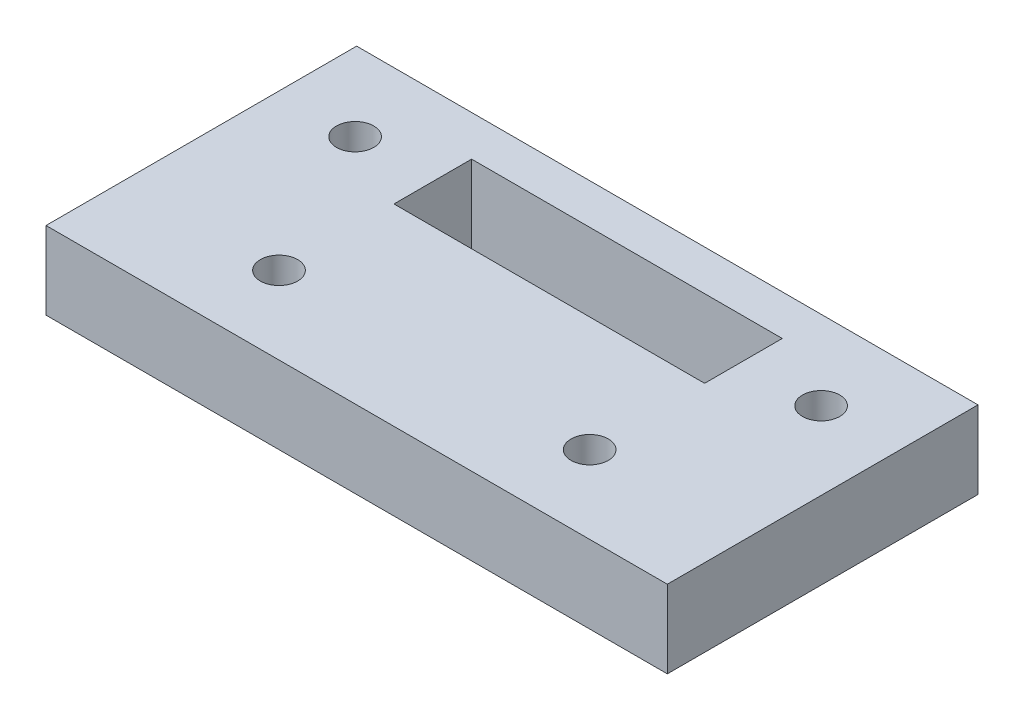
ISO-10303-21;
HEADER;
FILE_DESCRIPTION(('STEP AP214'),'2;1');
FILE_NAME('part.step','',(''),(''),'','','');
FILE_SCHEMA(('AUTOMOTIVE_DESIGN { 1 0 10303 214 1 1 1 1 }'));
ENDSEC;
DATA;
#1=APPLICATION_CONTEXT('core data for automotive mechanical design processes');
#2=APPLICATION_PROTOCOL_DEFINITION('international standard','automotive_design',2000,#1);
#3=PRODUCT_CONTEXT('',#1,'mechanical');
#4=PRODUCT('Part','Part','',(#3));
#5=PRODUCT_RELATED_PRODUCT_CATEGORY('part','',(#4));
#6=PRODUCT_DEFINITION_FORMATION('','',#4);
#7=PRODUCT_DEFINITION_CONTEXT('part definition',#1,'design');
#8=PRODUCT_DEFINITION('design','',#6,#7);
#9=PRODUCT_DEFINITION_SHAPE('','',#8);
#10=(LENGTH_UNIT() NAMED_UNIT(*) SI_UNIT(.MILLI.,.METRE.));
#11=(NAMED_UNIT(*) PLANE_ANGLE_UNIT() SI_UNIT($,.RADIAN.));
#12=(NAMED_UNIT(*) SI_UNIT($,.STERADIAN.) SOLID_ANGLE_UNIT());
#13=UNCERTAINTY_MEASURE_WITH_UNIT(LENGTH_MEASURE(1.E-05),#10,'distance_accuracy_value','');
#14=(GEOMETRIC_REPRESENTATION_CONTEXT(3) GLOBAL_UNCERTAINTY_ASSIGNED_CONTEXT((#13)) GLOBAL_UNIT_ASSIGNED_CONTEXT((#10,
#11,#12)) REPRESENTATION_CONTEXT('',''));
#15=CARTESIAN_POINT('',(0.,0.,0.));
#16=DIRECTION('',(0.,0.,1.));
#17=DIRECTION('',(1.,0.,0.));
#18=AXIS2_PLACEMENT_3D('',#15,#16,#17);
#19=CARTESIAN_POINT('',(0.,6.35,0.));
#20=DIRECTION('',(0.,1.,0.));
#21=DIRECTION('',(0.,0.,1.));
#22=AXIS2_PLACEMENT_3D('',#19,#20,#21);
#23=PLANE('',#22);
#24=CARTESIAN_POINT('',(12.7,6.35,19.05));
#25=DIRECTION('',(0.,1.,0.));
#26=DIRECTION('',(0.,0.,1.));
#27=AXIS2_PLACEMENT_3D('',#24,#25,#26);
#28=CIRCLE('',#27,1.524);
#29=CARTESIAN_POINT('',(12.7,6.35,20.574));
#30=VERTEX_POINT('',#29);
#31=EDGE_CURVE('E245',#30,#30,#28,.T.);
#32=ORIENTED_EDGE('',*,*,#31,.F.);
#33=EDGE_LOOP('',(#32));
#34=FACE_BOUND('',#33,.T.);
#35=CARTESIAN_POINT('',(6.35,6.35,6.477));
#36=DIRECTION('',(0.,1.,0.));
#37=DIRECTION('',(0.,0.,1.));
#38=AXIS2_PLACEMENT_3D('',#35,#36,#37);
#39=CIRCLE('',#38,1.524);
#40=CARTESIAN_POINT('',(6.35,6.35,8.001));
#41=VERTEX_POINT('',#40);
#42=EDGE_CURVE('E127',#41,#41,#39,.T.);
#43=ORIENTED_EDGE('',*,*,#42,.F.);
#44=EDGE_LOOP('',(#43));
#45=FACE_BOUND('',#44,.T.);
#46=DIRECTION('',(0.,0.,1.));
#47=VECTOR('',#46,1.);
#48=CARTESIAN_POINT('',(0.,6.35,0.));
#49=LINE('',#48,#47);
#50=CARTESIAN_POINT('',(0.,6.35,0.));
#51=VERTEX_POINT('',#50);
#52=CARTESIAN_POINT('',(0.,6.35,25.4));
#53=VERTEX_POINT('',#52);
#54=EDGE_CURVE('E137',#51,#53,#49,.T.);
#55=ORIENTED_EDGE('',*,*,#54,.T.);
#56=DIRECTION('',(1.,0.,0.));
#57=VECTOR('',#56,1.);
#58=CARTESIAN_POINT('',(0.,6.35,25.4));
#59=LINE('',#58,#57);
#60=CARTESIAN_POINT('',(50.8,6.35,25.4));
#61=VERTEX_POINT('',#60);
#62=EDGE_CURVE('E140',#53,#61,#59,.T.);
#63=ORIENTED_EDGE('',*,*,#62,.T.);
#64=DIRECTION('',(0.,0.,-1.));
#65=VECTOR('',#64,1.);
#66=CARTESIAN_POINT('',(50.8,6.35,0.));
#67=LINE('',#66,#65);
#68=CARTESIAN_POINT('',(50.8,6.35,0.));
#69=VERTEX_POINT('',#68);
#70=EDGE_CURVE('E143',#61,#69,#67,.T.);
#71=ORIENTED_EDGE('',*,*,#70,.T.);
#72=DIRECTION('',(-1.,0.,0.));
#73=VECTOR('',#72,1.);
#74=CARTESIAN_POINT('',(0.,6.35,0.));
#75=LINE('',#74,#73);
#76=EDGE_CURVE('E145',#69,#51,#75,.T.);
#77=ORIENTED_EDGE('',*,*,#76,.T.);
#78=EDGE_LOOP('',(#55,#63,#71,#77));
#79=FACE_BOUND('',#78,.T.);
#80=DIRECTION('',(1.,0.,0.));
#81=VECTOR('',#80,1.);
#82=CARTESIAN_POINT('',(12.7,6.35,9.652));
#83=LINE('',#82,#81);
#84=CARTESIAN_POINT('',(12.7,6.35,9.652));
#85=VERTEX_POINT('',#84);
#86=CARTESIAN_POINT('',(38.1,6.35,9.652));
#87=VERTEX_POINT('',#86);
#88=EDGE_CURVE('E106',#85,#87,#83,.T.);
#89=ORIENTED_EDGE('',*,*,#88,.F.);
#90=DIRECTION('',(0.,0.,1.));
#91=VECTOR('',#90,1.);
#92=CARTESIAN_POINT('',(12.7,6.35,3.302));
#93=LINE('',#92,#91);
#94=CARTESIAN_POINT('',(12.7,6.35,3.302));
#95=VERTEX_POINT('',#94);
#96=EDGE_CURVE('E98',#95,#85,#93,.T.);
#97=ORIENTED_EDGE('',*,*,#96,.F.);
#98=DIRECTION('',(-1.,0.,0.));
#99=VECTOR('',#98,1.);
#100=CARTESIAN_POINT('',(12.7,6.35,3.302));
#101=LINE('',#100,#99);
#102=CARTESIAN_POINT('',(38.1,6.35,3.302));
#103=VERTEX_POINT('',#102);
#104=EDGE_CURVE('E121',#103,#95,#101,.T.);
#105=ORIENTED_EDGE('',*,*,#104,.F.);
#106=DIRECTION('',(0.,0.,-1.));
#107=VECTOR('',#106,1.);
#108=CARTESIAN_POINT('',(38.1,6.35,3.302));
#109=LINE('',#108,#107);
#110=EDGE_CURVE('E119',#87,#103,#109,.T.);
#111=ORIENTED_EDGE('',*,*,#110,.F.);
#112=EDGE_LOOP('',(#89,#97,#105,#111));
#113=FACE_BOUND('',#112,.T.);
#114=CARTESIAN_POINT('',(44.45,6.35,6.477));
#115=DIRECTION('',(0.,1.,0.));
#116=DIRECTION('',(0.,0.,-1.));
#117=AXIS2_PLACEMENT_3D('',#114,#115,#116);
#118=CIRCLE('',#117,1.524);
#119=CARTESIAN_POINT('',(44.45,6.35,4.953));
#120=VERTEX_POINT('',#119);
#121=EDGE_CURVE('E251',#120,#120,#118,.T.);
#122=ORIENTED_EDGE('',*,*,#121,.F.);
#123=EDGE_LOOP('',(#122));
#124=FACE_BOUND('',#123,.T.);
#125=CARTESIAN_POINT('',(38.1,6.35,19.05));
#126=DIRECTION('',(0.,1.,0.));
#127=DIRECTION('',(0.,0.,-1.));
#128=AXIS2_PLACEMENT_3D('',#125,#126,#127);
#129=CIRCLE('',#128,1.524);
#130=CARTESIAN_POINT('',(38.1,6.35,17.526));
#131=VERTEX_POINT('',#130);
#132=EDGE_CURVE('E236',#131,#131,#129,.T.);
#133=ORIENTED_EDGE('',*,*,#132,.F.);
#134=EDGE_LOOP('',(#133));
#135=FACE_BOUND('',#134,.T.);
#136=ADVANCED_FACE('F33',(#34,#45,#79,#113,#124,#135),#23,.T.);
#137=CARTESIAN_POINT('',(0.,0.,0.));
#138=DIRECTION('',(0.,1.,0.));
#139=DIRECTION('',(0.,0.,1.));
#140=AXIS2_PLACEMENT_3D('',#137,#138,#139);
#141=PLANE('',#140);
#142=DIRECTION('',(0.,0.,1.));
#143=VECTOR('',#142,1.);
#144=CARTESIAN_POINT('',(0.,0.,0.));
#145=LINE('',#144,#143);
#146=CARTESIAN_POINT('',(0.,0.,0.));
#147=VERTEX_POINT('',#146);
#148=CARTESIAN_POINT('',(0.,0.,25.4));
#149=VERTEX_POINT('',#148);
#150=EDGE_CURVE('E114',#147,#149,#145,.T.);
#151=ORIENTED_EDGE('',*,*,#150,.F.);
#152=DIRECTION('',(-1.,0.,0.));
#153=VECTOR('',#152,1.);
#154=CARTESIAN_POINT('',(0.,0.,0.));
#155=LINE('',#154,#153);
#156=CARTESIAN_POINT('',(50.8,0.,0.));
#157=VERTEX_POINT('',#156);
#158=EDGE_CURVE('E141',#157,#147,#155,.T.);
#159=ORIENTED_EDGE('',*,*,#158,.F.);
#160=DIRECTION('',(0.,0.,-1.));
#161=VECTOR('',#160,1.);
#162=CARTESIAN_POINT('',(50.8,0.,0.));
#163=LINE('',#162,#161);
#164=CARTESIAN_POINT('',(50.8,0.,25.4));
#165=VERTEX_POINT('',#164);
#166=EDGE_CURVE('E152',#165,#157,#163,.T.);
#167=ORIENTED_EDGE('',*,*,#166,.F.);
#168=DIRECTION('',(1.,0.,0.));
#169=VECTOR('',#168,1.);
#170=CARTESIAN_POINT('',(0.,0.,25.4));
#171=LINE('',#170,#169);
#172=EDGE_CURVE('E150',#149,#165,#171,.T.);
#173=ORIENTED_EDGE('',*,*,#172,.F.);
#174=EDGE_LOOP('',(#151,#159,#167,#173));
#175=FACE_BOUND('',#174,.T.);
#176=DIRECTION('',(0.,0.,1.));
#177=VECTOR('',#176,1.);
#178=CARTESIAN_POINT('',(12.7,0.,3.302));
#179=LINE('',#178,#177);
#180=CARTESIAN_POINT('',(12.7,0.,3.302));
#181=VERTEX_POINT('',#180);
#182=CARTESIAN_POINT('',(12.7,0.,9.652));
#183=VERTEX_POINT('',#182);
#184=EDGE_CURVE('E56',#181,#183,#179,.T.);
#185=ORIENTED_EDGE('',*,*,#184,.T.);
#186=DIRECTION('',(1.,0.,0.));
#187=VECTOR('',#186,1.);
#188=CARTESIAN_POINT('',(12.7,0.,9.652));
#189=LINE('',#188,#187);
#190=CARTESIAN_POINT('',(38.1,0.,9.652));
#191=VERTEX_POINT('',#190);
#192=EDGE_CURVE('E113',#183,#191,#189,.T.);
#193=ORIENTED_EDGE('',*,*,#192,.T.);
#194=DIRECTION('',(0.,0.,-1.));
#195=VECTOR('',#194,1.);
#196=CARTESIAN_POINT('',(38.1,0.,3.302));
#197=LINE('',#196,#195);
#198=CARTESIAN_POINT('',(38.1,0.,3.302));
#199=VERTEX_POINT('',#198);
#200=EDGE_CURVE('E129',#191,#199,#197,.T.);
#201=ORIENTED_EDGE('',*,*,#200,.T.);
#202=DIRECTION('',(-1.,0.,0.));
#203=VECTOR('',#202,1.);
#204=CARTESIAN_POINT('',(12.7,0.,3.302));
#205=LINE('',#204,#203);
#206=EDGE_CURVE('E107',#199,#181,#205,.T.);
#207=ORIENTED_EDGE('',*,*,#206,.T.);
#208=EDGE_LOOP('',(#185,#193,#201,#207));
#209=FACE_BOUND('',#208,.T.);
#210=CARTESIAN_POINT('',(6.35,0.,6.477));
#211=DIRECTION('',(0.,1.,0.));
#212=DIRECTION('',(0.,0.,1.));
#213=AXIS2_PLACEMENT_3D('',#210,#211,#212);
#214=CIRCLE('',#213,1.524);
#215=CARTESIAN_POINT('',(6.35,0.,8.001));
#216=VERTEX_POINT('',#215);
#217=EDGE_CURVE('E254',#216,#216,#214,.T.);
#218=ORIENTED_EDGE('',*,*,#217,.T.);
#219=EDGE_LOOP('',(#218));
#220=FACE_BOUND('',#219,.T.);
#221=CARTESIAN_POINT('',(44.45,0.,6.477));
#222=DIRECTION('',(0.,1.,0.));
#223=DIRECTION('',(0.,0.,-1.));
#224=AXIS2_PLACEMENT_3D('',#221,#222,#223);
#225=CIRCLE('',#224,1.524);
#226=CARTESIAN_POINT('',(44.45,0.,4.953));
#227=VERTEX_POINT('',#226);
#228=EDGE_CURVE('E248',#227,#227,#225,.T.);
#229=ORIENTED_EDGE('',*,*,#228,.T.);
#230=EDGE_LOOP('',(#229));
#231=FACE_BOUND('',#230,.T.);
#232=CARTESIAN_POINT('',(12.7,0.,19.05));
#233=DIRECTION('',(0.,1.,0.));
#234=DIRECTION('',(0.,0.,1.));
#235=AXIS2_PLACEMENT_3D('',#232,#233,#234);
#236=CIRCLE('',#235,1.524);
#237=CARTESIAN_POINT('',(12.7,0.,20.574));
#238=VERTEX_POINT('',#237);
#239=EDGE_CURVE('E242',#238,#238,#236,.T.);
#240=ORIENTED_EDGE('',*,*,#239,.T.);
#241=EDGE_LOOP('',(#240));
#242=FACE_BOUND('',#241,.T.);
#243=CARTESIAN_POINT('',(38.1,0.,19.05));
#244=DIRECTION('',(0.,1.,0.));
#245=DIRECTION('',(0.,0.,-1.));
#246=AXIS2_PLACEMENT_3D('',#243,#244,#245);
#247=CIRCLE('',#246,1.524);
#248=CARTESIAN_POINT('',(38.1,0.,17.526));
#249=VERTEX_POINT('',#248);
#250=EDGE_CURVE('E239',#249,#249,#247,.T.);
#251=ORIENTED_EDGE('',*,*,#250,.T.);
#252=EDGE_LOOP('',(#251));
#253=FACE_BOUND('',#252,.T.);
#254=ADVANCED_FACE('F170',(#175,#209,#220,#231,#242,#253),#141,.F.);
#255=CARTESIAN_POINT('',(0.,6.35,0.));
#256=DIRECTION('',(1.,0.,0.));
#257=DIRECTION('',(0.,0.,-1.));
#258=AXIS2_PLACEMENT_3D('',#255,#256,#257);
#259=PLANE('',#258);
#260=ORIENTED_EDGE('',*,*,#150,.T.);
#261=DIRECTION('',(0.,-1.,0.));
#262=VECTOR('',#261,1.);
#263=CARTESIAN_POINT('',(0.,6.35,25.4));
#264=LINE('',#263,#262);
#265=EDGE_CURVE('E11',#53,#149,#264,.T.);
#266=ORIENTED_EDGE('',*,*,#265,.F.);
#267=ORIENTED_EDGE('',*,*,#54,.F.);
#268=DIRECTION('',(0.,-1.,0.));
#269=VECTOR('',#268,1.);
#270=CARTESIAN_POINT('',(0.,6.35,0.));
#271=LINE('',#270,#269);
#272=EDGE_CURVE('E147',#51,#147,#271,.T.);
#273=ORIENTED_EDGE('',*,*,#272,.T.);
#274=EDGE_LOOP('',(#260,#266,#267,#273));
#275=FACE_BOUND('',#274,.T.);
#276=ADVANCED_FACE('F35',(#275),#259,.F.);
#277=CARTESIAN_POINT('',(0.,6.35,25.4));
#278=DIRECTION('',(0.,0.,-1.));
#279=DIRECTION('',(-1.,0.,0.));
#280=AXIS2_PLACEMENT_3D('',#277,#278,#279);
#281=PLANE('',#280);
#282=ORIENTED_EDGE('',*,*,#172,.T.);
#283=DIRECTION('',(0.,-1.,0.));
#284=VECTOR('',#283,1.);
#285=CARTESIAN_POINT('',(50.8,6.35,25.4));
#286=LINE('',#285,#284);
#287=EDGE_CURVE('E41',#61,#165,#286,.T.);
#288=ORIENTED_EDGE('',*,*,#287,.F.);
#289=ORIENTED_EDGE('',*,*,#62,.F.);
#290=ORIENTED_EDGE('',*,*,#265,.T.);
#291=EDGE_LOOP('',(#282,#288,#289,#290));
#292=FACE_BOUND('',#291,.T.);
#293=ADVANCED_FACE('F180',(#292),#281,.F.);
#294=CARTESIAN_POINT('',(50.8,6.35,0.));
#295=DIRECTION('',(-1.,0.,0.));
#296=DIRECTION('',(0.,0.,1.));
#297=AXIS2_PLACEMENT_3D('',#294,#295,#296);
#298=PLANE('',#297);
#299=ORIENTED_EDGE('',*,*,#166,.T.);
#300=DIRECTION('',(0.,-1.,0.));
#301=VECTOR('',#300,1.);
#302=CARTESIAN_POINT('',(50.8,6.35,0.));
#303=LINE('',#302,#301);
#304=EDGE_CURVE('E157',#69,#157,#303,.T.);
#305=ORIENTED_EDGE('',*,*,#304,.F.);
#306=ORIENTED_EDGE('',*,*,#70,.F.);
#307=ORIENTED_EDGE('',*,*,#287,.T.);
#308=EDGE_LOOP('',(#299,#305,#306,#307));
#309=FACE_BOUND('',#308,.T.);
#310=ADVANCED_FACE('F164',(#309),#298,.F.);
#311=CARTESIAN_POINT('',(0.,6.35,0.));
#312=DIRECTION('',(0.,0.,1.));
#313=DIRECTION('',(1.,0.,0.));
#314=AXIS2_PLACEMENT_3D('',#311,#312,#313);
#315=PLANE('',#314);
#316=ORIENTED_EDGE('',*,*,#158,.T.);
#317=ORIENTED_EDGE('',*,*,#272,.F.);
#318=ORIENTED_EDGE('',*,*,#76,.F.);
#319=ORIENTED_EDGE('',*,*,#304,.T.);
#320=EDGE_LOOP('',(#316,#317,#318,#319));
#321=FACE_BOUND('',#320,.T.);
#322=ADVANCED_FACE('F174',(#321),#315,.F.);
#323=CARTESIAN_POINT('',(12.7,6.35,3.302));
#324=DIRECTION('',(1.,0.,0.));
#325=DIRECTION('',(0.,0.,-1.));
#326=AXIS2_PLACEMENT_3D('',#323,#324,#325);
#327=PLANE('',#326);
#328=ORIENTED_EDGE('',*,*,#184,.F.);
#329=DIRECTION('',(0.,-1.,0.));
#330=VECTOR('',#329,1.);
#331=CARTESIAN_POINT('',(12.7,6.35,3.302));
#332=LINE('',#331,#330);
#333=EDGE_CURVE('E102',#95,#181,#332,.T.);
#334=ORIENTED_EDGE('',*,*,#333,.F.);
#335=ORIENTED_EDGE('',*,*,#96,.T.);
#336=DIRECTION('',(0.,-1.,0.));
#337=VECTOR('',#336,1.);
#338=CARTESIAN_POINT('',(12.7,6.35,9.652));
#339=LINE('',#338,#337);
#340=EDGE_CURVE('E101',#85,#183,#339,.T.);
#341=ORIENTED_EDGE('',*,*,#340,.T.);
#342=EDGE_LOOP('',(#328,#334,#335,#341));
#343=FACE_BOUND('',#342,.T.);
#344=ADVANCED_FACE('F100',(#343),#327,.T.);
#345=CARTESIAN_POINT('',(12.7,6.35,9.652));
#346=DIRECTION('',(0.,0.,-1.));
#347=DIRECTION('',(-1.,0.,0.));
#348=AXIS2_PLACEMENT_3D('',#345,#346,#347);
#349=PLANE('',#348);
#350=ORIENTED_EDGE('',*,*,#192,.F.);
#351=ORIENTED_EDGE('',*,*,#340,.F.);
#352=ORIENTED_EDGE('',*,*,#88,.T.);
#353=DIRECTION('',(0.,-1.,0.));
#354=VECTOR('',#353,1.);
#355=CARTESIAN_POINT('',(38.1,6.35,9.652));
#356=LINE('',#355,#354);
#357=EDGE_CURVE('E115',#87,#191,#356,.T.);
#358=ORIENTED_EDGE('',*,*,#357,.T.);
#359=EDGE_LOOP('',(#350,#351,#352,#358));
#360=FACE_BOUND('',#359,.T.);
#361=ADVANCED_FACE('F110',(#360),#349,.T.);
#362=CARTESIAN_POINT('',(38.1,6.35,3.302));
#363=DIRECTION('',(-1.,0.,0.));
#364=DIRECTION('',(0.,0.,1.));
#365=AXIS2_PLACEMENT_3D('',#362,#363,#364);
#366=PLANE('',#365);
#367=ORIENTED_EDGE('',*,*,#200,.F.);
#368=ORIENTED_EDGE('',*,*,#357,.F.);
#369=ORIENTED_EDGE('',*,*,#110,.T.);
#370=DIRECTION('',(0.,-1.,0.));
#371=VECTOR('',#370,1.);
#372=CARTESIAN_POINT('',(38.1,6.35,3.302));
#373=LINE('',#372,#371);
#374=EDGE_CURVE('E48',#103,#199,#373,.T.);
#375=ORIENTED_EDGE('',*,*,#374,.T.);
#376=EDGE_LOOP('',(#367,#368,#369,#375));
#377=FACE_BOUND('',#376,.T.);
#378=ADVANCED_FACE('F206',(#377),#366,.T.);
#379=CARTESIAN_POINT('',(12.7,6.35,3.302));
#380=DIRECTION('',(0.,0.,1.));
#381=DIRECTION('',(1.,0.,0.));
#382=AXIS2_PLACEMENT_3D('',#379,#380,#381);
#383=PLANE('',#382);
#384=ORIENTED_EDGE('',*,*,#206,.F.);
#385=ORIENTED_EDGE('',*,*,#374,.F.);
#386=ORIENTED_EDGE('',*,*,#104,.T.);
#387=ORIENTED_EDGE('',*,*,#333,.T.);
#388=EDGE_LOOP('',(#384,#385,#386,#387));
#389=FACE_BOUND('',#388,.T.);
#390=ADVANCED_FACE('F210',(#389),#383,.T.);
#391=CARTESIAN_POINT('',(6.35,6.35,6.477));
#392=DIRECTION('',(0.,-1.,0.));
#393=DIRECTION('',(0.,0.,-1.));
#394=AXIS2_PLACEMENT_3D('',#391,#392,#393);
#395=CYLINDRICAL_SURFACE('',#394,1.524);
#396=ORIENTED_EDGE('',*,*,#42,.T.);
#397=EDGE_LOOP('',(#396));
#398=FACE_BOUND('',#397,.T.);
#399=ORIENTED_EDGE('',*,*,#217,.F.);
#400=EDGE_LOOP('',(#399));
#401=FACE_BOUND('',#400,.T.);
#402=ADVANCED_FACE('F216',(#398,#401),#395,.F.);
#403=CARTESIAN_POINT('',(44.45,6.35,6.477));
#404=DIRECTION('',(0.,-1.,0.));
#405=DIRECTION('',(0.,0.,-1.));
#406=AXIS2_PLACEMENT_3D('',#403,#404,#405);
#407=CYLINDRICAL_SURFACE('',#406,1.524);
#408=ORIENTED_EDGE('',*,*,#121,.T.);
#409=EDGE_LOOP('',(#408));
#410=FACE_BOUND('',#409,.T.);
#411=ORIENTED_EDGE('',*,*,#228,.F.);
#412=EDGE_LOOP('',(#411));
#413=FACE_BOUND('',#412,.T.);
#414=ADVANCED_FACE('F219',(#410,#413),#407,.F.);
#415=CARTESIAN_POINT('',(12.7,6.35,19.05));
#416=DIRECTION('',(0.,-1.,0.));
#417=DIRECTION('',(0.,0.,-1.));
#418=AXIS2_PLACEMENT_3D('',#415,#416,#417);
#419=CYLINDRICAL_SURFACE('',#418,1.524);
#420=ORIENTED_EDGE('',*,*,#31,.T.);
#421=EDGE_LOOP('',(#420));
#422=FACE_BOUND('',#421,.T.);
#423=ORIENTED_EDGE('',*,*,#239,.F.);
#424=EDGE_LOOP('',(#423));
#425=FACE_BOUND('',#424,.T.);
#426=ADVANCED_FACE('F223',(#422,#425),#419,.F.);
#427=CARTESIAN_POINT('',(38.1,6.35,19.05));
#428=DIRECTION('',(0.,-1.,0.));
#429=DIRECTION('',(0.,0.,-1.));
#430=AXIS2_PLACEMENT_3D('',#427,#428,#429);
#431=CYLINDRICAL_SURFACE('',#430,1.524);
#432=ORIENTED_EDGE('',*,*,#132,.T.);
#433=EDGE_LOOP('',(#432));
#434=FACE_BOUND('',#433,.T.);
#435=ORIENTED_EDGE('',*,*,#250,.F.);
#436=EDGE_LOOP('',(#435));
#437=FACE_BOUND('',#436,.T.);
#438=ADVANCED_FACE('F227',(#434,#437),#431,.F.);
#439=CLOSED_SHELL('',(#136,#254,#276,#293,#310,#322,#344,#361,#378,#390,#402,#414,#426,#438));
#440=MANIFOLD_SOLID_BREP('B2',#439);
#441=ADVANCED_BREP_SHAPE_REPRESENTATION('',(#18,#440),#14);
#442=SHAPE_DEFINITION_REPRESENTATION(#9,#441);
ENDSEC;
END-ISO-10303-21;
